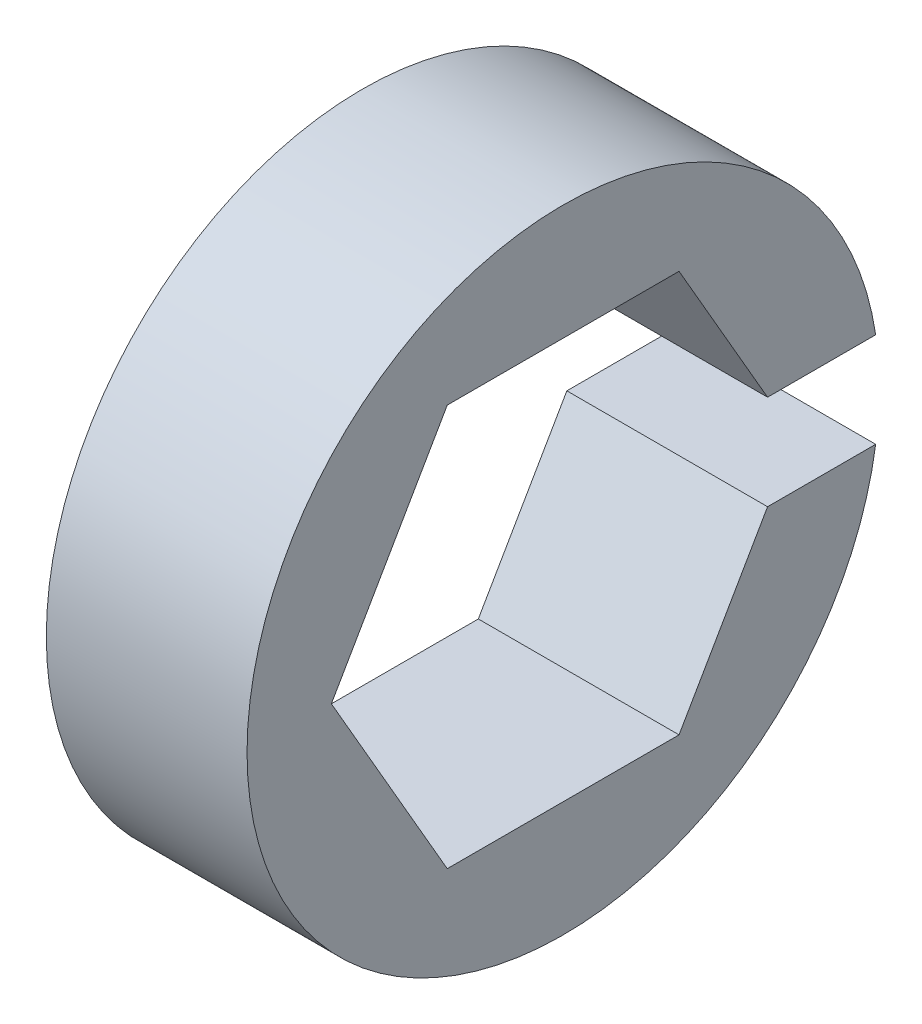
ISO-10303-21;
HEADER;
FILE_DESCRIPTION(('STEP AP214'),'2;1');
FILE_NAME('part.step','',(''),(''),'','','');
FILE_SCHEMA(('AUTOMOTIVE_DESIGN { 1 0 10303 214 1 1 1 1 }'));
ENDSEC;
DATA;
#1=APPLICATION_CONTEXT('core data for automotive mechanical design processes');
#2=APPLICATION_PROTOCOL_DEFINITION('international standard','automotive_design',2000,#1);
#3=PRODUCT_CONTEXT('',#1,'mechanical');
#4=PRODUCT('Part','Part','',(#3));
#5=PRODUCT_RELATED_PRODUCT_CATEGORY('part','',(#4));
#6=PRODUCT_DEFINITION_FORMATION('','',#4);
#7=PRODUCT_DEFINITION_CONTEXT('part definition',#1,'design');
#8=PRODUCT_DEFINITION('design','',#6,#7);
#9=PRODUCT_DEFINITION_SHAPE('','',#8);
#10=(LENGTH_UNIT() NAMED_UNIT(*) SI_UNIT(.MILLI.,.METRE.));
#11=(NAMED_UNIT(*) PLANE_ANGLE_UNIT() SI_UNIT($,.RADIAN.));
#12=(NAMED_UNIT(*) SI_UNIT($,.STERADIAN.) SOLID_ANGLE_UNIT());
#13=UNCERTAINTY_MEASURE_WITH_UNIT(LENGTH_MEASURE(1.E-05),#10,'distance_accuracy_value','');
#14=(GEOMETRIC_REPRESENTATION_CONTEXT(3) GLOBAL_UNCERTAINTY_ASSIGNED_CONTEXT((#13)) GLOBAL_UNIT_ASSIGNED_CONTEXT((#10,
#11,#12)) REPRESENTATION_CONTEXT('',''));
#15=CARTESIAN_POINT('',(0.,0.,0.));
#16=DIRECTION('',(0.,0.,1.));
#17=DIRECTION('',(1.,0.,0.));
#18=AXIS2_PLACEMENT_3D('',#15,#16,#17);
#19=CARTESIAN_POINT('',(6.35,0.,0.));
#20=DIRECTION('',(1.,0.,0.));
#21=DIRECTION('',(0.,0.,-1.));
#22=AXIS2_PLACEMENT_3D('',#19,#20,#21);
#23=PLANE('',#22);
#24=DIRECTION('',(0.,0.,1.));
#25=VECTOR('',#24,1.);
#26=CARTESIAN_POINT('',(6.35,1.5,-5.81015098971704));
#27=LINE('',#26,#25);
#28=CARTESIAN_POINT('',(6.35,1.5,-9.88685996664259));
#29=VERTEX_POINT('',#28);
#30=CARTESIAN_POINT('',(6.35,1.5,-6.46632301492381));
#31=VERTEX_POINT('',#30);
#32=EDGE_CURVE('E61',#29,#31,#27,.T.);
#33=ORIENTED_EDGE('',*,*,#32,.F.);
#34=CARTESIAN_POINT('',(6.35,0.,0.));
#35=DIRECTION('',(1.,0.,0.));
#36=DIRECTION('',(0.,0.,-1.));
#37=AXIS2_PLACEMENT_3D('',#34,#35,#36);
#38=CIRCLE('',#37,10.);
#39=CARTESIAN_POINT('',(6.35,-1.5,-9.88685996664259));
#40=VERTEX_POINT('',#39);
#41=EDGE_CURVE('E119',#29,#40,#38,.T.);
#42=ORIENTED_EDGE('',*,*,#41,.T.);
#43=DIRECTION('',(0.,0.,-1.));
#44=VECTOR('',#43,1.);
#45=CARTESIAN_POINT('',(6.35,-1.5,-5.81015098971704));
#46=LINE('',#45,#44);
#47=CARTESIAN_POINT('',(6.35,-1.5,-6.46632301492383));
#48=VERTEX_POINT('',#47);
#49=EDGE_CURVE('E108',#48,#40,#46,.T.);
#50=ORIENTED_EDGE('',*,*,#49,.F.);
#51=DIRECTION('',(0.,0.866025403784441,-0.499999999999995));
#52=VECTOR('',#51,1.);
#53=CARTESIAN_POINT('',(6.35,-6.34999999999996,-3.6661742093542));
#54=LINE('',#53,#52);
#55=CARTESIAN_POINT('',(6.35,-6.34999999999996,-3.6661742093542));
#56=VERTEX_POINT('',#55);
#57=EDGE_CURVE('E117',#56,#48,#54,.T.);
#58=ORIENTED_EDGE('',*,*,#57,.F.);
#59=DIRECTION('',(0.,0.,-1.));
#60=VECTOR('',#59,1.);
#61=CARTESIAN_POINT('',(6.35,-6.35000000000004,3.66617420935407));
#62=LINE('',#61,#60);
#63=CARTESIAN_POINT('',(6.35,-6.35000000000004,3.66617420935407));
#64=VERTEX_POINT('',#63);
#65=EDGE_CURVE('E143',#64,#56,#62,.T.);
#66=ORIENTED_EDGE('',*,*,#65,.F.);
#67=DIRECTION('',(0.,-0.866025403784435,-0.500000000000007));
#68=VECTOR('',#67,1.);
#69=CARTESIAN_POINT('',(6.35,0.,7.33234841870825));
#70=LINE('',#69,#68);
#71=CARTESIAN_POINT('',(6.35,0.,7.33234841870825));
#72=VERTEX_POINT('',#71);
#73=EDGE_CURVE('E140',#72,#64,#70,.T.);
#74=ORIENTED_EDGE('',*,*,#73,.F.);
#75=DIRECTION('',(0.,-0.866025403784441,0.499999999999995));
#76=VECTOR('',#75,1.);
#77=CARTESIAN_POINT('',(6.35,6.34999999999999,3.66617420935416));
#78=LINE('',#77,#76);
#79=CARTESIAN_POINT('',(6.35,6.34999999999999,3.66617420935416));
#80=VERTEX_POINT('',#79);
#81=EDGE_CURVE('E138',#80,#72,#78,.T.);
#82=ORIENTED_EDGE('',*,*,#81,.F.);
#83=DIRECTION('',(0.,0.,1.));
#84=VECTOR('',#83,1.);
#85=CARTESIAN_POINT('',(6.35,6.35000000000001,-3.66617420935411));
#86=LINE('',#85,#84);
#87=CARTESIAN_POINT('',(6.35,6.35000000000001,-3.66617420935411));
#88=VERTEX_POINT('',#87);
#89=EDGE_CURVE('E128',#88,#80,#86,.T.);
#90=ORIENTED_EDGE('',*,*,#89,.F.);
#91=DIRECTION('',(0.,0.866025403784438,0.500000000000001));
#92=VECTOR('',#91,1.);
#93=CARTESIAN_POINT('',(6.35,0.,-7.33234841870825));
#94=LINE('',#93,#92);
#95=EDGE_CURVE('E125',#31,#88,#94,.T.);
#96=ORIENTED_EDGE('',*,*,#95,.F.);
#97=EDGE_LOOP('',(#33,#42,#50,#58,#66,#74,#82,#90,#96));
#98=FACE_BOUND('',#97,.T.);
#99=ADVANCED_FACE('F39',(#98),#23,.T.);
#100=CARTESIAN_POINT('',(0.,0.,0.));
#101=DIRECTION('',(1.,0.,0.));
#102=DIRECTION('',(0.,0.,-1.));
#103=AXIS2_PLACEMENT_3D('',#100,#101,#102);
#104=PLANE('',#103);
#105=CARTESIAN_POINT('',(0.,0.,0.));
#106=DIRECTION('',(1.,0.,0.));
#107=DIRECTION('',(0.,0.,-1.));
#108=AXIS2_PLACEMENT_3D('',#105,#106,#107);
#109=CIRCLE('',#108,10.);
#110=CARTESIAN_POINT('',(0.,1.5,-9.88685996664259));
#111=VERTEX_POINT('',#110);
#112=CARTESIAN_POINT('',(0.,-1.5,-9.88685996664259));
#113=VERTEX_POINT('',#112);
#114=EDGE_CURVE('E167',#111,#113,#109,.T.);
#115=ORIENTED_EDGE('',*,*,#114,.F.);
#116=DIRECTION('',(0.,0.,1.));
#117=VECTOR('',#116,1.);
#118=CARTESIAN_POINT('',(0.,1.5,-5.81015098971704));
#119=LINE('',#118,#117);
#120=CARTESIAN_POINT('',(0.,1.5,-6.46632301492381));
#121=VERTEX_POINT('',#120);
#122=EDGE_CURVE('E172',#111,#121,#119,.T.);
#123=ORIENTED_EDGE('',*,*,#122,.T.);
#124=DIRECTION('',(0.,0.866025403784438,0.500000000000001));
#125=VECTOR('',#124,1.);
#126=CARTESIAN_POINT('',(0.,0.,-7.33234841870825));
#127=LINE('',#126,#125);
#128=CARTESIAN_POINT('',(0.,6.35000000000001,-3.66617420935411));
#129=VERTEX_POINT('',#128);
#130=EDGE_CURVE('E147',#121,#129,#127,.T.);
#131=ORIENTED_EDGE('',*,*,#130,.T.);
#132=DIRECTION('',(0.,0.,1.));
#133=VECTOR('',#132,1.);
#134=CARTESIAN_POINT('',(0.,6.35000000000001,-3.66617420935411));
#135=LINE('',#134,#133);
#136=CARTESIAN_POINT('',(0.,6.34999999999999,3.66617420935416));
#137=VERTEX_POINT('',#136);
#138=EDGE_CURVE('E149',#129,#137,#135,.T.);
#139=ORIENTED_EDGE('',*,*,#138,.T.);
#140=DIRECTION('',(0.,-0.866025403784441,0.499999999999995));
#141=VECTOR('',#140,1.);
#142=CARTESIAN_POINT('',(0.,6.34999999999999,3.66617420935416));
#143=LINE('',#142,#141);
#144=CARTESIAN_POINT('',(0.,0.,7.33234841870825));
#145=VERTEX_POINT('',#144);
#146=EDGE_CURVE('E152',#137,#145,#143,.T.);
#147=ORIENTED_EDGE('',*,*,#146,.T.);
#148=DIRECTION('',(0.,-0.866025403784435,-0.500000000000007));
#149=VECTOR('',#148,1.);
#150=CARTESIAN_POINT('',(0.,0.,7.33234841870825));
#151=LINE('',#150,#149);
#152=CARTESIAN_POINT('',(0.,-6.35000000000004,3.66617420935407));
#153=VERTEX_POINT('',#152);
#154=EDGE_CURVE('E131',#145,#153,#151,.T.);
#155=ORIENTED_EDGE('',*,*,#154,.T.);
#156=DIRECTION('',(0.,0.,-1.));
#157=VECTOR('',#156,1.);
#158=CARTESIAN_POINT('',(0.,-6.35000000000004,3.66617420935407));
#159=LINE('',#158,#157);
#160=CARTESIAN_POINT('',(0.,-6.34999999999996,-3.6661742093542));
#161=VERTEX_POINT('',#160);
#162=EDGE_CURVE('E126',#153,#161,#159,.T.);
#163=ORIENTED_EDGE('',*,*,#162,.T.);
#164=DIRECTION('',(0.,0.866025403784441,-0.499999999999995));
#165=VECTOR('',#164,1.);
#166=CARTESIAN_POINT('',(0.,-6.34999999999996,-3.6661742093542));
#167=LINE('',#166,#165);
#168=CARTESIAN_POINT('',(0.,-1.5,-6.46632301492383));
#169=VERTEX_POINT('',#168);
#170=EDGE_CURVE('E145',#161,#169,#167,.T.);
#171=ORIENTED_EDGE('',*,*,#170,.T.);
#172=DIRECTION('',(0.,0.,-1.));
#173=VECTOR('',#172,1.);
#174=CARTESIAN_POINT('',(0.,-1.5,-5.81015098971704));
#175=LINE('',#174,#173);
#176=EDGE_CURVE('E53',#169,#113,#175,.T.);
#177=ORIENTED_EDGE('',*,*,#176,.T.);
#178=EDGE_LOOP('',(#115,#123,#131,#139,#147,#155,#163,#171,#177));
#179=FACE_BOUND('',#178,.T.);
#180=ADVANCED_FACE('F179',(#179),#104,.F.);
#181=CARTESIAN_POINT('',(6.35,0.,0.));
#182=DIRECTION('',(-1.,0.,0.));
#183=DIRECTION('',(0.,0.,1.));
#184=AXIS2_PLACEMENT_3D('',#181,#182,#183);
#185=CYLINDRICAL_SURFACE('',#184,10.);
#186=ORIENTED_EDGE('',*,*,#41,.F.);
#187=DIRECTION('',(-1.,0.,0.));
#188=VECTOR('',#187,1.);
#189=CARTESIAN_POINT('',(6.35,1.5,-9.88685996664259));
#190=LINE('',#189,#188);
#191=EDGE_CURVE('E180',#29,#111,#190,.T.);
#192=ORIENTED_EDGE('',*,*,#191,.T.);
#193=ORIENTED_EDGE('',*,*,#114,.T.);
#194=DIRECTION('',(-1.,0.,0.));
#195=VECTOR('',#194,1.);
#196=CARTESIAN_POINT('',(6.35,-1.5,-9.88685996664259));
#197=LINE('',#196,#195);
#198=EDGE_CURVE('E134',#113,#40,#197,.F.);
#199=ORIENTED_EDGE('',*,*,#198,.T.);
#200=EDGE_LOOP('',(#186,#192,#193,#199));
#201=FACE_BOUND('',#200,.T.);
#202=ADVANCED_FACE('F41',(#201),#185,.T.);
#203=CARTESIAN_POINT('',(6.35,-6.34999999999996,-3.6661742093542));
#204=DIRECTION('',(0.,0.499999999999995,0.866025403784441));
#205=DIRECTION('',(0.,-0.866025403784441,0.499999999999995));
#206=AXIS2_PLACEMENT_3D('',#203,#204,#205);
#207=PLANE('',#206);
#208=DIRECTION('',(1.,0.,0.));
#209=VECTOR('',#208,1.);
#210=CARTESIAN_POINT('',(6.35,-1.5,-6.46632301492383));
#211=LINE('',#210,#209);
#212=EDGE_CURVE('E11',#169,#48,#211,.T.);
#213=ORIENTED_EDGE('',*,*,#212,.F.);
#214=ORIENTED_EDGE('',*,*,#170,.F.);
#215=DIRECTION('',(-1.,0.,0.));
#216=VECTOR('',#215,1.);
#217=CARTESIAN_POINT('',(6.35,-6.34999999999996,-3.6661742093542));
#218=LINE('',#217,#216);
#219=EDGE_CURVE('E124',#56,#161,#218,.T.);
#220=ORIENTED_EDGE('',*,*,#219,.F.);
#221=ORIENTED_EDGE('',*,*,#57,.T.);
#222=EDGE_LOOP('',(#213,#214,#220,#221));
#223=FACE_BOUND('',#222,.T.);
#224=ADVANCED_FACE('F122',(#223),#207,.T.);
#225=CARTESIAN_POINT('',(6.35,0.,-7.33234841870825));
#226=DIRECTION('',(0.,-0.500000000000001,0.866025403784438));
#227=DIRECTION('',(0.,-0.866025403784438,-0.500000000000001));
#228=AXIS2_PLACEMENT_3D('',#225,#226,#227);
#229=PLANE('',#228);
#230=DIRECTION('',(-1.,0.,0.));
#231=VECTOR('',#230,1.);
#232=CARTESIAN_POINT('',(6.35,1.5,-6.46632301492381));
#233=LINE('',#232,#231);
#234=EDGE_CURVE('E47',#31,#121,#233,.T.);
#235=ORIENTED_EDGE('',*,*,#234,.F.);
#236=ORIENTED_EDGE('',*,*,#95,.T.);
#237=DIRECTION('',(-1.,0.,0.));
#238=VECTOR('',#237,1.);
#239=CARTESIAN_POINT('',(6.35,6.35000000000001,-3.66617420935411));
#240=LINE('',#239,#238);
#241=EDGE_CURVE('E164',#88,#129,#240,.T.);
#242=ORIENTED_EDGE('',*,*,#241,.T.);
#243=ORIENTED_EDGE('',*,*,#130,.F.);
#244=EDGE_LOOP('',(#235,#236,#242,#243));
#245=FACE_BOUND('',#244,.T.);
#246=ADVANCED_FACE('F182',(#245),#229,.T.);
#247=CARTESIAN_POINT('',(6.35,6.35000000000001,-3.66617420935411));
#248=DIRECTION('',(0.,-1.,0.));
#249=DIRECTION('',(0.,0.,-1.));
#250=AXIS2_PLACEMENT_3D('',#247,#248,#249);
#251=PLANE('',#250);
#252=ORIENTED_EDGE('',*,*,#138,.F.);
#253=ORIENTED_EDGE('',*,*,#241,.F.);
#254=ORIENTED_EDGE('',*,*,#89,.T.);
#255=DIRECTION('',(-1.,0.,0.));
#256=VECTOR('',#255,1.);
#257=CARTESIAN_POINT('',(6.35,6.34999999999999,3.66617420935416));
#258=LINE('',#257,#256);
#259=EDGE_CURVE('E162',#80,#137,#258,.T.);
#260=ORIENTED_EDGE('',*,*,#259,.T.);
#261=EDGE_LOOP('',(#252,#253,#254,#260));
#262=FACE_BOUND('',#261,.T.);
#263=ADVANCED_FACE('F187',(#262),#251,.T.);
#264=CARTESIAN_POINT('',(6.35,6.34999999999999,3.66617420935416));
#265=DIRECTION('',(0.,-0.499999999999995,-0.866025403784441));
#266=DIRECTION('',(0.,0.866025403784442,-0.499999999999995));
#267=AXIS2_PLACEMENT_3D('',#264,#265,#266);
#268=PLANE('',#267);
#269=ORIENTED_EDGE('',*,*,#146,.F.);
#270=ORIENTED_EDGE('',*,*,#259,.F.);
#271=ORIENTED_EDGE('',*,*,#81,.T.);
#272=DIRECTION('',(-1.,0.,0.));
#273=VECTOR('',#272,1.);
#274=CARTESIAN_POINT('',(6.35,0.,7.33234841870825));
#275=LINE('',#274,#273);
#276=EDGE_CURVE('E160',#72,#145,#275,.T.);
#277=ORIENTED_EDGE('',*,*,#276,.T.);
#278=EDGE_LOOP('',(#269,#270,#271,#277));
#279=FACE_BOUND('',#278,.T.);
#280=ADVANCED_FACE('F192',(#279),#268,.T.);
#281=CARTESIAN_POINT('',(6.35,0.,7.33234841870825));
#282=DIRECTION('',(0.,0.500000000000007,-0.866025403784434));
#283=DIRECTION('',(0.,0.866025403784435,0.500000000000007));
#284=AXIS2_PLACEMENT_3D('',#281,#282,#283);
#285=PLANE('',#284);
#286=ORIENTED_EDGE('',*,*,#154,.F.);
#287=ORIENTED_EDGE('',*,*,#276,.F.);
#288=ORIENTED_EDGE('',*,*,#73,.T.);
#289=DIRECTION('',(-1.,0.,0.));
#290=VECTOR('',#289,1.);
#291=CARTESIAN_POINT('',(6.35,-6.35000000000004,3.66617420935407));
#292=LINE('',#291,#290);
#293=EDGE_CURVE('E158',#64,#153,#292,.T.);
#294=ORIENTED_EDGE('',*,*,#293,.T.);
#295=EDGE_LOOP('',(#286,#287,#288,#294));
#296=FACE_BOUND('',#295,.T.);
#297=ADVANCED_FACE('F197',(#296),#285,.T.);
#298=CARTESIAN_POINT('',(6.35,-6.35000000000004,3.66617420935407));
#299=DIRECTION('',(0.,1.,0.));
#300=DIRECTION('',(0.,0.,1.));
#301=AXIS2_PLACEMENT_3D('',#298,#299,#300);
#302=PLANE('',#301);
#303=ORIENTED_EDGE('',*,*,#162,.F.);
#304=ORIENTED_EDGE('',*,*,#293,.F.);
#305=ORIENTED_EDGE('',*,*,#65,.T.);
#306=ORIENTED_EDGE('',*,*,#219,.T.);
#307=EDGE_LOOP('',(#303,#304,#305,#306));
#308=FACE_BOUND('',#307,.T.);
#309=ADVANCED_FACE('F200',(#308),#302,.T.);
#310=CARTESIAN_POINT('',(0.,1.5,-5.81015098971704));
#311=DIRECTION('',(0.,1.,0.));
#312=DIRECTION('',(0.,0.,1.));
#313=AXIS2_PLACEMENT_3D('',#310,#311,#312);
#314=PLANE('',#313);
#315=ORIENTED_EDGE('',*,*,#32,.T.);
#316=ORIENTED_EDGE('',*,*,#234,.T.);
#317=ORIENTED_EDGE('',*,*,#122,.F.);
#318=ORIENTED_EDGE('',*,*,#191,.F.);
#319=EDGE_LOOP('',(#315,#316,#317,#318));
#320=FACE_BOUND('',#319,.T.);
#321=ADVANCED_FACE('F171',(#320),#314,.F.);
#322=CARTESIAN_POINT('',(0.,-1.5,-5.81015098971704));
#323=DIRECTION('',(0.,-1.,0.));
#324=DIRECTION('',(0.,0.,-1.));
#325=AXIS2_PLACEMENT_3D('',#322,#323,#324);
#326=PLANE('',#325);
#327=ORIENTED_EDGE('',*,*,#176,.F.);
#328=ORIENTED_EDGE('',*,*,#212,.T.);
#329=ORIENTED_EDGE('',*,*,#49,.T.);
#330=ORIENTED_EDGE('',*,*,#198,.F.);
#331=EDGE_LOOP('',(#327,#328,#329,#330));
#332=FACE_BOUND('',#331,.T.);
#333=ADVANCED_FACE('F107',(#332),#326,.F.);
#334=CLOSED_SHELL('',(#99,#180,#202,#224,#246,#263,#280,#297,#309,#321,#333));
#335=MANIFOLD_SOLID_BREP('B2',#334);
#336=ADVANCED_BREP_SHAPE_REPRESENTATION('',(#18,#335),#14);
#337=SHAPE_DEFINITION_REPRESENTATION(#9,#336);
ENDSEC;
END-ISO-10303-21;
